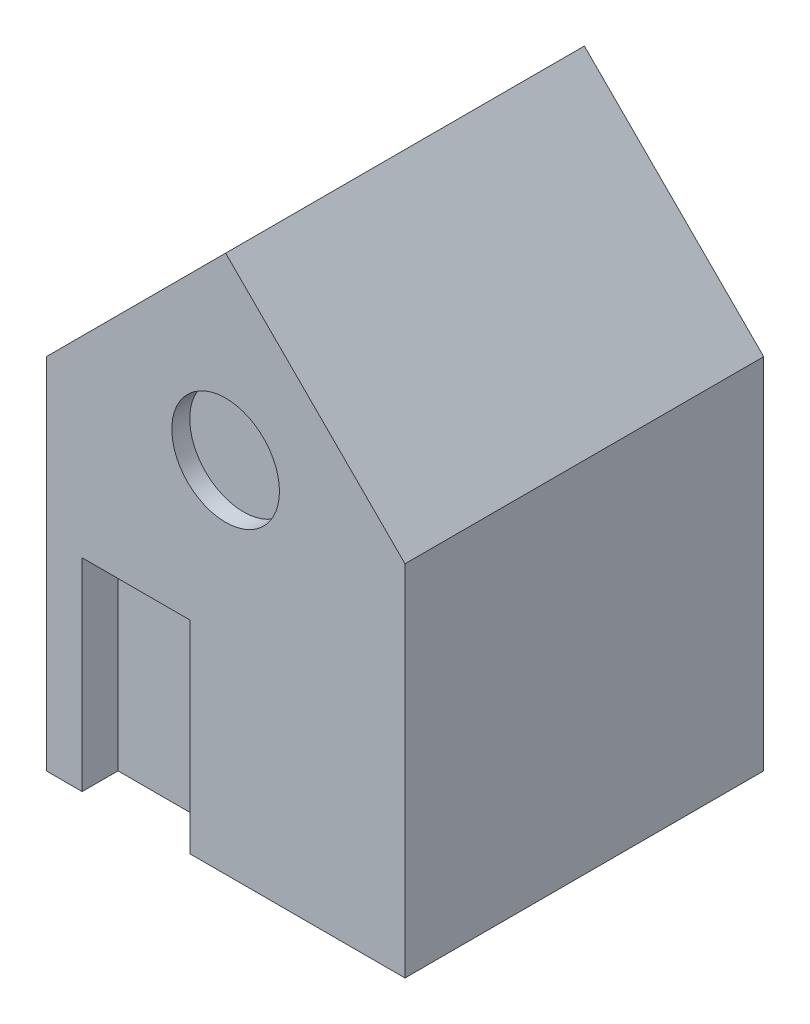
ISO-10303-21;
HEADER;
FILE_DESCRIPTION(('STEP AP214'),'2;1');
FILE_NAME('part.step','',(''),(''),'','','');
FILE_SCHEMA(('AUTOMOTIVE_DESIGN { 1 0 10303 214 1 1 1 1 }'));
ENDSEC;
DATA;
#1=APPLICATION_CONTEXT('core data for automotive mechanical design processes');
#2=APPLICATION_PROTOCOL_DEFINITION('international standard','automotive_design',2000,#1);
#3=PRODUCT_CONTEXT('',#1,'mechanical');
#4=PRODUCT('Part','Part','',(#3));
#5=PRODUCT_RELATED_PRODUCT_CATEGORY('part','',(#4));
#6=PRODUCT_DEFINITION_FORMATION('','',#4);
#7=PRODUCT_DEFINITION_CONTEXT('part definition',#1,'design');
#8=PRODUCT_DEFINITION('design','',#6,#7);
#9=PRODUCT_DEFINITION_SHAPE('','',#8);
#10=(LENGTH_UNIT() NAMED_UNIT(*) SI_UNIT(.MILLI.,.METRE.));
#11=(NAMED_UNIT(*) PLANE_ANGLE_UNIT() SI_UNIT($,.RADIAN.));
#12=(NAMED_UNIT(*) SI_UNIT($,.STERADIAN.) SOLID_ANGLE_UNIT());
#13=UNCERTAINTY_MEASURE_WITH_UNIT(LENGTH_MEASURE(1.E-05),#10,'distance_accuracy_value','');
#14=(GEOMETRIC_REPRESENTATION_CONTEXT(3) GLOBAL_UNCERTAINTY_ASSIGNED_CONTEXT((#13)) GLOBAL_UNIT_ASSIGNED_CONTEXT((#10,
#11,#12)) REPRESENTATION_CONTEXT('',''));
#15=CARTESIAN_POINT('',(0.,0.,0.));
#16=DIRECTION('',(0.,0.,1.));
#17=DIRECTION('',(1.,0.,0.));
#18=AXIS2_PLACEMENT_3D('',#15,#16,#17);
#19=CARTESIAN_POINT('',(-50.,100.,50.));
#20=DIRECTION('',(1.,0.,0.));
#21=DIRECTION('',(0.,1.,0.));
#22=AXIS2_PLACEMENT_3D('',#19,#20,#21);
#23=PLANE('',#22);
#24=DIRECTION('',(0.,-1.,0.));
#25=VECTOR('',#24,1.);
#26=CARTESIAN_POINT('',(-50.,100.,-50.));
#27=LINE('',#26,#25);
#28=CARTESIAN_POINT('',(-50.,100.,-50.));
#29=VERTEX_POINT('',#28);
#30=CARTESIAN_POINT('',(-50.,0.,-50.));
#31=VERTEX_POINT('',#30);
#32=EDGE_CURVE('E128',#29,#31,#27,.T.);
#33=ORIENTED_EDGE('',*,*,#32,.T.);
#34=DIRECTION('',(0.,0.,-1.));
#35=VECTOR('',#34,1.);
#36=CARTESIAN_POINT('',(-50.,0.,50.));
#37=LINE('',#36,#35);
#38=CARTESIAN_POINT('',(-50.,0.,50.));
#39=VERTEX_POINT('',#38);
#40=EDGE_CURVE('E11',#39,#31,#37,.T.);
#41=ORIENTED_EDGE('',*,*,#40,.F.);
#42=DIRECTION('',(0.,-1.,0.));
#43=VECTOR('',#42,1.);
#44=CARTESIAN_POINT('',(-50.,100.,50.));
#45=LINE('',#44,#43);
#46=CARTESIAN_POINT('',(-50.,100.,50.));
#47=VERTEX_POINT('',#46);
#48=EDGE_CURVE('E138',#47,#39,#45,.T.);
#49=ORIENTED_EDGE('',*,*,#48,.F.);
#50=DIRECTION('',(0.,0.,-1.));
#51=VECTOR('',#50,1.);
#52=CARTESIAN_POINT('',(-50.,100.,50.));
#53=LINE('',#52,#51);
#54=EDGE_CURVE('E124',#47,#29,#53,.T.);
#55=ORIENTED_EDGE('',*,*,#54,.T.);
#56=EDGE_LOOP('',(#33,#41,#49,#55));
#57=FACE_BOUND('',#56,.T.);
#58=ADVANCED_FACE('F37',(#57),#23,.F.);
#59=CARTESIAN_POINT('',(-50.,0.,50.));
#60=DIRECTION('',(0.,1.,0.));
#61=DIRECTION('',(0.,0.,1.));
#62=AXIS2_PLACEMENT_3D('',#59,#60,#61);
#63=PLANE('',#62);
#64=DIRECTION('',(1.,0.,0.));
#65=VECTOR('',#64,1.);
#66=CARTESIAN_POINT('',(-40.,0.,40.));
#67=LINE('',#66,#65);
#68=CARTESIAN_POINT('',(-40.,0.,40.));
#69=VERTEX_POINT('',#68);
#70=CARTESIAN_POINT('',(-10.,0.,40.));
#71=VERTEX_POINT('',#70);
#72=EDGE_CURVE('E184',#69,#71,#67,.T.);
#73=ORIENTED_EDGE('',*,*,#72,.F.);
#74=DIRECTION('',(0.,0.,1.));
#75=VECTOR('',#74,1.);
#76=CARTESIAN_POINT('',(-40.,0.,40.));
#77=LINE('',#76,#75);
#78=CARTESIAN_POINT('',(-40.,0.,50.));
#79=VERTEX_POINT('',#78);
#80=EDGE_CURVE('E149',#69,#79,#77,.T.);
#81=ORIENTED_EDGE('',*,*,#80,.T.);
#82=DIRECTION('',(1.,0.,0.));
#83=VECTOR('',#82,1.);
#84=CARTESIAN_POINT('',(-50.,0.,50.));
#85=LINE('',#84,#83);
#86=EDGE_CURVE('E92',#39,#79,#85,.T.);
#87=ORIENTED_EDGE('',*,*,#86,.F.);
#88=ORIENTED_EDGE('',*,*,#40,.T.);
#89=DIRECTION('',(1.,0.,0.));
#90=VECTOR('',#89,1.);
#91=CARTESIAN_POINT('',(-50.,0.,-50.));
#92=LINE('',#91,#90);
#93=CARTESIAN_POINT('',(50.,0.,-50.));
#94=VERTEX_POINT('',#93);
#95=EDGE_CURVE('E131',#31,#94,#92,.T.);
#96=ORIENTED_EDGE('',*,*,#95,.T.);
#97=DIRECTION('',(0.,0.,-1.));
#98=VECTOR('',#97,1.);
#99=CARTESIAN_POINT('',(50.,0.,50.));
#100=LINE('',#99,#98);
#101=CARTESIAN_POINT('',(50.,0.,50.));
#102=VERTEX_POINT('',#101);
#103=EDGE_CURVE('E44',#102,#94,#100,.T.);
#104=ORIENTED_EDGE('',*,*,#103,.F.);
#105=CARTESIAN_POINT('',(-10.,0.,50.));
#106=VERTEX_POINT('',#105);
#107=EDGE_CURVE('E108',#106,#102,#85,.T.);
#108=ORIENTED_EDGE('',*,*,#107,.F.);
#109=DIRECTION('',(0.,0.,1.));
#110=VECTOR('',#109,1.);
#111=CARTESIAN_POINT('',(-10.,0.,40.));
#112=LINE('',#111,#110);
#113=EDGE_CURVE('E51',#71,#106,#112,.T.);
#114=ORIENTED_EDGE('',*,*,#113,.F.);
#115=EDGE_LOOP('',(#73,#81,#87,#88,#96,#104,#108,#114));
#116=FACE_BOUND('',#115,.T.);
#117=ADVANCED_FACE('F207',(#116),#63,.F.);
#118=CARTESIAN_POINT('',(50.,0.,50.));
#119=DIRECTION('',(-1.,0.,0.));
#120=DIRECTION('',(0.,-1.,0.));
#121=AXIS2_PLACEMENT_3D('',#118,#119,#120);
#122=PLANE('',#121);
#123=DIRECTION('',(0.,1.,0.));
#124=VECTOR('',#123,1.);
#125=CARTESIAN_POINT('',(50.,0.,-50.));
#126=LINE('',#125,#124);
#127=CARTESIAN_POINT('',(50.,100.,-50.));
#128=VERTEX_POINT('',#127);
#129=EDGE_CURVE('E117',#94,#128,#126,.T.);
#130=ORIENTED_EDGE('',*,*,#129,.T.);
#131=DIRECTION('',(0.,0.,-1.));
#132=VECTOR('',#131,1.);
#133=CARTESIAN_POINT('',(50.,100.,50.));
#134=LINE('',#133,#132);
#135=CARTESIAN_POINT('',(50.,100.,50.));
#136=VERTEX_POINT('',#135);
#137=EDGE_CURVE('E114',#136,#128,#134,.T.);
#138=ORIENTED_EDGE('',*,*,#137,.F.);
#139=DIRECTION('',(0.,1.,0.));
#140=VECTOR('',#139,1.);
#141=CARTESIAN_POINT('',(50.,0.,50.));
#142=LINE('',#141,#140);
#143=EDGE_CURVE('E100',#102,#136,#142,.T.);
#144=ORIENTED_EDGE('',*,*,#143,.F.);
#145=ORIENTED_EDGE('',*,*,#103,.T.);
#146=EDGE_LOOP('',(#130,#138,#144,#145));
#147=FACE_BOUND('',#146,.T.);
#148=ADVANCED_FACE('F115',(#147),#122,.F.);
#149=CARTESIAN_POINT('',(50.,100.,50.));
#150=DIRECTION('',(-0.707106781186548,-0.707106781186547,0.));
#151=DIRECTION('',(0.707106781186547,-0.707106781186548,0.));
#152=AXIS2_PLACEMENT_3D('',#149,#150,#151);
#153=PLANE('',#152);
#154=DIRECTION('',(-0.707106781186547,0.707106781186548,0.));
#155=VECTOR('',#154,1.);
#156=CARTESIAN_POINT('',(50.,100.,-50.));
#157=LINE('',#156,#155);
#158=CARTESIAN_POINT('',(0.,150.,-50.));
#159=VERTEX_POINT('',#158);
#160=EDGE_CURVE('E135',#128,#159,#157,.T.);
#161=ORIENTED_EDGE('',*,*,#160,.T.);
#162=DIRECTION('',(0.,0.,-1.));
#163=VECTOR('',#162,1.);
#164=CARTESIAN_POINT('',(0.,150.,50.));
#165=LINE('',#164,#163);
#166=CARTESIAN_POINT('',(0.,150.,50.));
#167=VERTEX_POINT('',#166);
#168=EDGE_CURVE('E120',#167,#159,#165,.T.);
#169=ORIENTED_EDGE('',*,*,#168,.F.);
#170=DIRECTION('',(-0.707106781186547,0.707106781186548,0.));
#171=VECTOR('',#170,1.);
#172=CARTESIAN_POINT('',(50.,100.,50.));
#173=LINE('',#172,#171);
#174=EDGE_CURVE('E105',#136,#167,#173,.T.);
#175=ORIENTED_EDGE('',*,*,#174,.F.);
#176=ORIENTED_EDGE('',*,*,#137,.T.);
#177=EDGE_LOOP('',(#161,#169,#175,#176));
#178=FACE_BOUND('',#177,.T.);
#179=ADVANCED_FACE('F122',(#178),#153,.F.);
#180=CARTESIAN_POINT('',(0.,150.,50.));
#181=DIRECTION('',(0.707106781186549,-0.707106781186546,0.));
#182=DIRECTION('',(0.707106781186546,0.707106781186549,0.));
#183=AXIS2_PLACEMENT_3D('',#180,#181,#182);
#184=PLANE('',#183);
#185=DIRECTION('',(-0.707106781186546,-0.707106781186549,0.));
#186=VECTOR('',#185,1.);
#187=CARTESIAN_POINT('',(0.,150.,-50.));
#188=LINE('',#187,#186);
#189=EDGE_CURVE('E84',#159,#29,#188,.T.);
#190=ORIENTED_EDGE('',*,*,#189,.T.);
#191=ORIENTED_EDGE('',*,*,#54,.F.);
#192=DIRECTION('',(-0.707106781186546,-0.707106781186549,0.));
#193=VECTOR('',#192,1.);
#194=CARTESIAN_POINT('',(0.,150.,50.));
#195=LINE('',#194,#193);
#196=EDGE_CURVE('E60',#167,#47,#195,.T.);
#197=ORIENTED_EDGE('',*,*,#196,.F.);
#198=ORIENTED_EDGE('',*,*,#168,.T.);
#199=EDGE_LOOP('',(#190,#191,#197,#198));
#200=FACE_BOUND('',#199,.T.);
#201=ADVANCED_FACE('F143',(#200),#184,.F.);
#202=CARTESIAN_POINT('',(0.,0.,50.));
#203=DIRECTION('',(0.,0.,1.));
#204=DIRECTION('',(1.,0.,0.));
#205=AXIS2_PLACEMENT_3D('',#202,#203,#204);
#206=PLANE('',#205);
#207=CARTESIAN_POINT('',(0.,100.,50.));
#208=DIRECTION('',(0.,0.,1.));
#209=DIRECTION('',(1.,0.,0.));
#210=AXIS2_PLACEMENT_3D('',#207,#208,#209);
#211=CIRCLE('',#210,15.);
#212=CARTESIAN_POINT('',(15.,100.,50.));
#213=VERTEX_POINT('',#212);
#214=EDGE_CURVE('E199',#213,#213,#211,.T.);
#215=ORIENTED_EDGE('',*,*,#214,.F.);
#216=EDGE_LOOP('',(#215));
#217=FACE_BOUND('',#216,.T.);
#218=DIRECTION('',(0.,-1.,0.));
#219=VECTOR('',#218,1.);
#220=CARTESIAN_POINT('',(-40.,0.,50.));
#221=LINE('',#220,#219);
#222=CARTESIAN_POINT('',(-40.,56.4513020809628,50.));
#223=VERTEX_POINT('',#222);
#224=EDGE_CURVE('E154',#223,#79,#221,.T.);
#225=ORIENTED_EDGE('',*,*,#224,.F.);
#226=DIRECTION('',(-1.,0.,0.));
#227=VECTOR('',#226,1.);
#228=CARTESIAN_POINT('',(-40.,56.4513020809628,50.));
#229=LINE('',#228,#227);
#230=CARTESIAN_POINT('',(-10.,56.4513020809628,50.));
#231=VERTEX_POINT('',#230);
#232=EDGE_CURVE('E180',#231,#223,#229,.T.);
#233=ORIENTED_EDGE('',*,*,#232,.F.);
#234=DIRECTION('',(0.,1.,0.));
#235=VECTOR('',#234,1.);
#236=CARTESIAN_POINT('',(-10.,0.,50.));
#237=LINE('',#236,#235);
#238=EDGE_CURVE('E182',#106,#231,#237,.T.);
#239=ORIENTED_EDGE('',*,*,#238,.F.);
#240=ORIENTED_EDGE('',*,*,#107,.T.);
#241=ORIENTED_EDGE('',*,*,#143,.T.);
#242=ORIENTED_EDGE('',*,*,#174,.T.);
#243=ORIENTED_EDGE('',*,*,#196,.T.);
#244=ORIENTED_EDGE('',*,*,#48,.T.);
#245=ORIENTED_EDGE('',*,*,#86,.T.);
#246=EDGE_LOOP('',(#225,#233,#239,#240,#241,#242,#243,#244,#245));
#247=FACE_BOUND('',#246,.T.);
#248=ADVANCED_FACE('F103',(#217,#247),#206,.T.);
#249=CARTESIAN_POINT('',(0.,0.,-50.));
#250=DIRECTION('',(0.,0.,1.));
#251=DIRECTION('',(1.,0.,0.));
#252=AXIS2_PLACEMENT_3D('',#249,#250,#251);
#253=PLANE('',#252);
#254=ORIENTED_EDGE('',*,*,#32,.F.);
#255=ORIENTED_EDGE('',*,*,#189,.F.);
#256=ORIENTED_EDGE('',*,*,#160,.F.);
#257=ORIENTED_EDGE('',*,*,#129,.F.);
#258=ORIENTED_EDGE('',*,*,#95,.F.);
#259=EDGE_LOOP('',(#254,#255,#256,#257,#258));
#260=FACE_BOUND('',#259,.T.);
#261=ADVANCED_FACE('F142',(#260),#253,.F.);
#262=CARTESIAN_POINT('',(-40.,0.,40.));
#263=DIRECTION('',(-1.,0.,0.));
#264=DIRECTION('',(0.,0.,1.));
#265=AXIS2_PLACEMENT_3D('',#262,#263,#264);
#266=PLANE('',#265);
#267=ORIENTED_EDGE('',*,*,#224,.T.);
#268=ORIENTED_EDGE('',*,*,#80,.F.);
#269=DIRECTION('',(0.,-1.,0.));
#270=VECTOR('',#269,1.);
#271=CARTESIAN_POINT('',(-40.,0.,40.));
#272=LINE('',#271,#270);
#273=CARTESIAN_POINT('',(-40.,56.4513020809628,40.));
#274=VERTEX_POINT('',#273);
#275=EDGE_CURVE('E174',#274,#69,#272,.T.);
#276=ORIENTED_EDGE('',*,*,#275,.F.);
#277=DIRECTION('',(0.,0.,1.));
#278=VECTOR('',#277,1.);
#279=CARTESIAN_POINT('',(-40.,56.4513020809628,40.));
#280=LINE('',#279,#278);
#281=EDGE_CURVE('E132',#274,#223,#280,.T.);
#282=ORIENTED_EDGE('',*,*,#281,.T.);
#283=EDGE_LOOP('',(#267,#268,#276,#282));
#284=FACE_BOUND('',#283,.T.);
#285=ADVANCED_FACE('F173',(#284),#266,.F.);
#286=CARTESIAN_POINT('',(-40.,56.4513020809628,40.));
#287=DIRECTION('',(0.,1.,0.));
#288=DIRECTION('',(-1.,0.,0.));
#289=AXIS2_PLACEMENT_3D('',#286,#287,#288);
#290=PLANE('',#289);
#291=ORIENTED_EDGE('',*,*,#232,.T.);
#292=ORIENTED_EDGE('',*,*,#281,.F.);
#293=DIRECTION('',(-1.,0.,0.));
#294=VECTOR('',#293,1.);
#295=CARTESIAN_POINT('',(-40.,56.4513020809628,40.));
#296=LINE('',#295,#294);
#297=CARTESIAN_POINT('',(-10.,56.4513020809628,40.));
#298=VERTEX_POINT('',#297);
#299=EDGE_CURVE('E189',#298,#274,#296,.T.);
#300=ORIENTED_EDGE('',*,*,#299,.F.);
#301=DIRECTION('',(0.,0.,1.));
#302=VECTOR('',#301,1.);
#303=CARTESIAN_POINT('',(-10.,56.4513020809628,40.));
#304=LINE('',#303,#302);
#305=EDGE_CURVE('E178',#298,#231,#304,.T.);
#306=ORIENTED_EDGE('',*,*,#305,.T.);
#307=EDGE_LOOP('',(#291,#292,#300,#306));
#308=FACE_BOUND('',#307,.T.);
#309=ADVANCED_FACE('F181',(#308),#290,.F.);
#310=CARTESIAN_POINT('',(-10.,0.,40.));
#311=DIRECTION('',(1.,0.,0.));
#312=DIRECTION('',(0.,1.,0.));
#313=AXIS2_PLACEMENT_3D('',#310,#311,#312);
#314=PLANE('',#313);
#315=ORIENTED_EDGE('',*,*,#238,.T.);
#316=ORIENTED_EDGE('',*,*,#305,.F.);
#317=DIRECTION('',(0.,1.,0.));
#318=VECTOR('',#317,1.);
#319=CARTESIAN_POINT('',(-10.,0.,40.));
#320=LINE('',#319,#318);
#321=EDGE_CURVE('E191',#71,#298,#320,.T.);
#322=ORIENTED_EDGE('',*,*,#321,.F.);
#323=ORIENTED_EDGE('',*,*,#113,.T.);
#324=EDGE_LOOP('',(#315,#316,#322,#323));
#325=FACE_BOUND('',#324,.T.);
#326=ADVANCED_FACE('F226',(#325),#314,.F.);
#327=CARTESIAN_POINT('',(0.,0.,40.));
#328=DIRECTION('',(0.,0.,-1.));
#329=DIRECTION('',(-1.,0.,0.));
#330=AXIS2_PLACEMENT_3D('',#327,#328,#329);
#331=PLANE('',#330);
#332=ORIENTED_EDGE('',*,*,#275,.T.);
#333=ORIENTED_EDGE('',*,*,#72,.T.);
#334=ORIENTED_EDGE('',*,*,#321,.T.);
#335=ORIENTED_EDGE('',*,*,#299,.T.);
#336=EDGE_LOOP('',(#332,#333,#334,#335));
#337=FACE_BOUND('',#336,.T.);
#338=ADVANCED_FACE('F206',(#337),#331,.F.);
#339=CARTESIAN_POINT('',(0.,100.,45.));
#340=DIRECTION('',(0.,0.,1.));
#341=DIRECTION('',(1.,0.,0.));
#342=AXIS2_PLACEMENT_3D('',#339,#340,#341);
#343=CYLINDRICAL_SURFACE('',#342,15.);
#344=CARTESIAN_POINT('',(0.,100.,45.));
#345=DIRECTION('',(0.,0.,1.));
#346=DIRECTION('',(1.,0.,0.));
#347=AXIS2_PLACEMENT_3D('',#344,#345,#346);
#348=CIRCLE('',#347,15.);
#349=CARTESIAN_POINT('',(15.,100.,45.));
#350=VERTEX_POINT('',#349);
#351=EDGE_CURVE('E197',#350,#350,#348,.T.);
#352=ORIENTED_EDGE('',*,*,#351,.F.);
#353=EDGE_LOOP('',(#352));
#354=FACE_BOUND('',#353,.T.);
#355=ORIENTED_EDGE('',*,*,#214,.T.);
#356=EDGE_LOOP('',(#355));
#357=FACE_BOUND('',#356,.T.);
#358=ADVANCED_FACE('F233',(#354,#357),#343,.F.);
#359=CARTESIAN_POINT('',(0.,100.,45.));
#360=DIRECTION('',(0.,0.,1.));
#361=DIRECTION('',(1.,0.,0.));
#362=AXIS2_PLACEMENT_3D('',#359,#360,#361);
#363=PLANE('',#362);
#364=ORIENTED_EDGE('',*,*,#351,.T.);
#365=EDGE_LOOP('',(#364));
#366=FACE_BOUND('',#365,.T.);
#367=ADVANCED_FACE('F236',(#366),#363,.T.);
#368=CLOSED_SHELL('',(#58,#117,#148,#179,#201,#248,#261,#285,#309,#326,#338,#358,#367));
#369=MANIFOLD_SOLID_BREP('B2',#368);
#370=ADVANCED_BREP_SHAPE_REPRESENTATION('',(#18,#369),#14);
#371=SHAPE_DEFINITION_REPRESENTATION(#9,#370);
ENDSEC;
END-ISO-10303-21;
